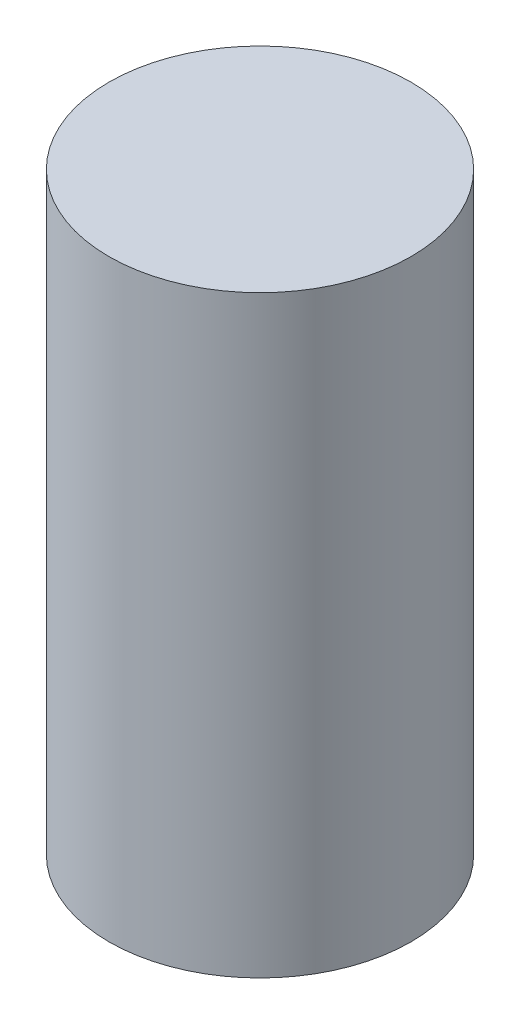
ISO-10303-21;
HEADER;
FILE_DESCRIPTION(('STEP AP214'),'2;1');
FILE_NAME('part.step','',(''),(''),'','','');
FILE_SCHEMA(('AUTOMOTIVE_DESIGN { 1 0 10303 214 1 1 1 1 }'));
ENDSEC;
DATA;
#1=APPLICATION_CONTEXT('core data for automotive mechanical design processes');
#2=APPLICATION_PROTOCOL_DEFINITION('international standard','automotive_design',2000,#1);
#3=PRODUCT_CONTEXT('',#1,'mechanical');
#4=PRODUCT('Part','Part','',(#3));
#5=PRODUCT_RELATED_PRODUCT_CATEGORY('part','',(#4));
#6=PRODUCT_DEFINITION_FORMATION('','',#4);
#7=PRODUCT_DEFINITION_CONTEXT('part definition',#1,'design');
#8=PRODUCT_DEFINITION('design','',#6,#7);
#9=PRODUCT_DEFINITION_SHAPE('','',#8);
#10=(LENGTH_UNIT() NAMED_UNIT(*) SI_UNIT(.MILLI.,.METRE.));
#11=(NAMED_UNIT(*) PLANE_ANGLE_UNIT() SI_UNIT($,.RADIAN.));
#12=(NAMED_UNIT(*) SI_UNIT($,.STERADIAN.) SOLID_ANGLE_UNIT());
#13=UNCERTAINTY_MEASURE_WITH_UNIT(LENGTH_MEASURE(1.E-05),#10,'distance_accuracy_value','');
#14=(GEOMETRIC_REPRESENTATION_CONTEXT(3) GLOBAL_UNCERTAINTY_ASSIGNED_CONTEXT((#13)) GLOBAL_UNIT_ASSIGNED_CONTEXT((#10,
#11,#12)) REPRESENTATION_CONTEXT('',''));
#15=CARTESIAN_POINT('',(0.,0.,0.));
#16=DIRECTION('',(0.,0.,1.));
#17=DIRECTION('',(1.,0.,0.));
#18=AXIS2_PLACEMENT_3D('',#15,#16,#17);
#19=CARTESIAN_POINT('',(0.,1100.,0.));
#20=DIRECTION('',(0.,-1.,0.));
#21=DIRECTION('',(0.,0.,-1.));
#22=AXIS2_PLACEMENT_3D('',#19,#20,#21);
#23=CYLINDRICAL_SURFACE('',#22,280.);
#24=CARTESIAN_POINT('',(0.,1100.,0.));
#25=DIRECTION('',(0.,1.,0.));
#26=DIRECTION('',(0.,0.,1.));
#27=AXIS2_PLACEMENT_3D('',#24,#25,#26);
#28=CIRCLE('',#27,280.);
#29=CARTESIAN_POINT('',(0.,1100.,280.));
#30=VERTEX_POINT('',#29);
#31=EDGE_CURVE('E10',#30,#30,#28,.T.);
#32=ORIENTED_EDGE('',*,*,#31,.F.);
#33=EDGE_LOOP('',(#32));
#34=FACE_BOUND('',#33,.T.);
#35=CARTESIAN_POINT('',(0.,0.,0.));
#36=DIRECTION('',(0.,1.,0.));
#37=DIRECTION('',(0.,0.,1.));
#38=AXIS2_PLACEMENT_3D('',#35,#36,#37);
#39=CIRCLE('',#38,280.);
#40=CARTESIAN_POINT('',(0.,0.,280.));
#41=VERTEX_POINT('',#40);
#42=EDGE_CURVE('E34',#41,#41,#39,.T.);
#43=ORIENTED_EDGE('',*,*,#42,.T.);
#44=EDGE_LOOP('',(#43));
#45=FACE_BOUND('',#44,.T.);
#46=ADVANCED_FACE('F31',(#34,#45),#23,.T.);
#47=CARTESIAN_POINT('',(0.,1100.,0.));
#48=DIRECTION('',(0.,1.,0.));
#49=DIRECTION('',(0.,0.,1.));
#50=AXIS2_PLACEMENT_3D('',#47,#48,#49);
#51=PLANE('',#50);
#52=ORIENTED_EDGE('',*,*,#31,.T.);
#53=EDGE_LOOP('',(#52));
#54=FACE_BOUND('',#53,.T.);
#55=ADVANCED_FACE('F46',(#54),#51,.T.);
#56=CARTESIAN_POINT('',(0.,0.,0.));
#57=DIRECTION('',(0.,1.,0.));
#58=DIRECTION('',(0.,0.,1.));
#59=AXIS2_PLACEMENT_3D('',#56,#57,#58);
#60=PLANE('',#59);
#61=ORIENTED_EDGE('',*,*,#42,.F.);
#62=EDGE_LOOP('',(#61));
#63=FACE_BOUND('',#62,.T.);
#64=ADVANCED_FACE('F44',(#63),#60,.F.);
#65=CLOSED_SHELL('',(#46,#55,#64));
#66=MANIFOLD_SOLID_BREP('B2',#65);
#67=ADVANCED_BREP_SHAPE_REPRESENTATION('',(#18,#66),#14);
#68=SHAPE_DEFINITION_REPRESENTATION(#9,#67);
ENDSEC;
END-ISO-10303-21;
